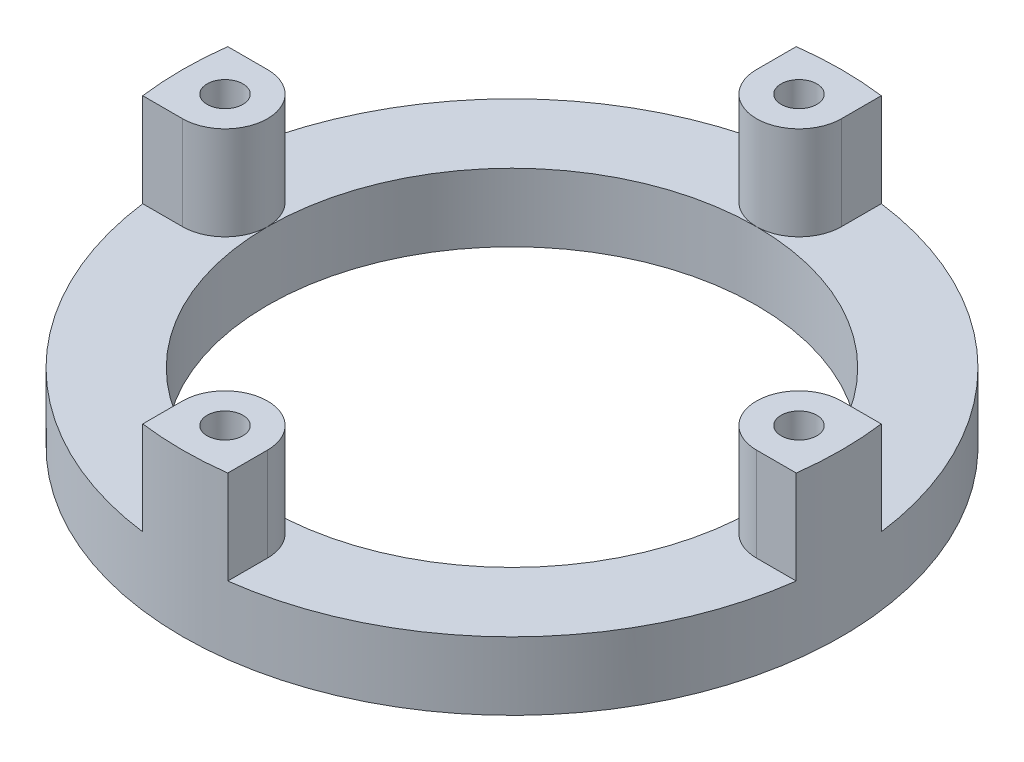
ISO-10303-21;
HEADER;
FILE_DESCRIPTION(('STEP AP214'),'2;1');
FILE_NAME('part.step','',(''),(''),'','','');
FILE_SCHEMA(('AUTOMOTIVE_DESIGN { 1 0 10303 214 1 1 1 1 }'));
ENDSEC;
DATA;
#1=APPLICATION_CONTEXT('core data for automotive mechanical design processes');
#2=APPLICATION_PROTOCOL_DEFINITION('international standard','automotive_design',2000,#1);
#3=PRODUCT_CONTEXT('',#1,'mechanical');
#4=PRODUCT('Part','Part','',(#3));
#5=PRODUCT_RELATED_PRODUCT_CATEGORY('part','',(#4));
#6=PRODUCT_DEFINITION_FORMATION('','',#4);
#7=PRODUCT_DEFINITION_CONTEXT('part definition',#1,'design');
#8=PRODUCT_DEFINITION('design','',#6,#7);
#9=PRODUCT_DEFINITION_SHAPE('','',#8);
#10=(LENGTH_UNIT() NAMED_UNIT(*) SI_UNIT(.MILLI.,.METRE.));
#11=(NAMED_UNIT(*) PLANE_ANGLE_UNIT() SI_UNIT($,.RADIAN.));
#12=(NAMED_UNIT(*) SI_UNIT($,.STERADIAN.) SOLID_ANGLE_UNIT());
#13=UNCERTAINTY_MEASURE_WITH_UNIT(LENGTH_MEASURE(1.E-05),#10,'distance_accuracy_value','');
#14=(GEOMETRIC_REPRESENTATION_CONTEXT(3) GLOBAL_UNCERTAINTY_ASSIGNED_CONTEXT((#13)) GLOBAL_UNIT_ASSIGNED_CONTEXT((#10,
#11,#12)) REPRESENTATION_CONTEXT('',''));
#15=CARTESIAN_POINT('',(0.,0.,0.));
#16=DIRECTION('',(0.,0.,1.));
#17=DIRECTION('',(1.,0.,0.));
#18=AXIS2_PLACEMENT_3D('',#15,#16,#17);
#19=CARTESIAN_POINT('',(0.,20.32,0.));
#20=DIRECTION('',(0.,1.,0.));
#21=DIRECTION('',(0.,0.,1.));
#22=AXIS2_PLACEMENT_3D('',#19,#20,#21);
#23=PLANE('',#22);
#24=CARTESIAN_POINT('',(0.,20.32,0.));
#25=DIRECTION('',(0.,1.,0.));
#26=DIRECTION('',(0.,0.,1.));
#27=AXIS2_PLACEMENT_3D('',#24,#25,#26);
#28=CIRCLE('',#27,98.425);
#29=CARTESIAN_POINT('',(12.7,20.32,97.6022060457652));
#30=VERTEX_POINT('',#29);
#31=CARTESIAN_POINT('',(97.6022060457653,20.32,12.699999999999));
#32=VERTEX_POINT('',#31);
#33=EDGE_CURVE('E443',#30,#32,#28,.T.);
#34=ORIENTED_EDGE('',*,*,#33,.T.);
#35=DIRECTION('',(1.,0.,0.));
#36=VECTOR('',#35,1.);
#37=CARTESIAN_POINT('',(85.7250000000001,20.32,12.6999999999991));
#38=LINE('',#37,#36);
#39=CARTESIAN_POINT('',(85.725,20.32,12.6999999999991));
#40=VERTEX_POINT('',#39);
#41=EDGE_CURVE('E55',#40,#32,#38,.T.);
#42=ORIENTED_EDGE('',*,*,#41,.F.);
#43=CARTESIAN_POINT('',(85.725,20.32,-8.97921713316983E-13));
#44=DIRECTION('',(0.,1.,0.));
#45=DIRECTION('',(-1.,0.,0.));
#46=AXIS2_PLACEMENT_3D('',#43,#44,#45);
#47=CIRCLE('',#46,12.7);
#48=CARTESIAN_POINT('',(73.025,20.32,-7.64896274307059E-13));
#49=VERTEX_POINT('',#48);
#50=EDGE_CURVE('E190',#49,#40,#47,.T.);
#51=ORIENTED_EDGE('',*,*,#50,.F.);
#52=CARTESIAN_POINT('',(0.,20.32,0.));
#53=DIRECTION('',(0.,1.,0.));
#54=DIRECTION('',(0.,0.,1.));
#55=AXIS2_PLACEMENT_3D('',#52,#53,#54);
#56=CIRCLE('',#55,73.025);
#57=CARTESIAN_POINT('',(0.,20.32,73.025));
#58=VERTEX_POINT('',#57);
#59=EDGE_CURVE('E456',#58,#49,#56,.T.);
#60=ORIENTED_EDGE('',*,*,#59,.F.);
#61=CARTESIAN_POINT('',(0.,20.32,85.725));
#62=DIRECTION('',(0.,1.,0.));
#63=DIRECTION('',(0.,0.,-1.));
#64=AXIS2_PLACEMENT_3D('',#61,#62,#63);
#65=CIRCLE('',#64,12.7);
#66=CARTESIAN_POINT('',(12.7,20.32,85.725));
#67=VERTEX_POINT('',#66);
#68=EDGE_CURVE('E211',#67,#58,#65,.T.);
#69=ORIENTED_EDGE('',*,*,#68,.F.);
#70=DIRECTION('',(0.,0.,-1.));
#71=VECTOR('',#70,1.);
#72=CARTESIAN_POINT('',(12.7,20.32,85.725));
#73=LINE('',#72,#71);
#74=EDGE_CURVE('E204',#30,#67,#73,.T.);
#75=ORIENTED_EDGE('',*,*,#74,.F.);
#76=EDGE_LOOP('',(#34,#42,#51,#60,#69,#75));
#77=FACE_BOUND('',#76,.T.);
#78=ADVANCED_FACE('F40',(#77),#23,.T.);
#79=CARTESIAN_POINT('',(-97.6022060457651,20.32,12.7000000000003));
#80=VERTEX_POINT('',#79);
#81=CARTESIAN_POINT('',(-12.7,20.32,97.6022060457652));
#82=VERTEX_POINT('',#81);
#83=EDGE_CURVE('E312',#80,#82,#28,.T.);
#84=ORIENTED_EDGE('',*,*,#83,.T.);
#85=DIRECTION('',(0.,0.,1.));
#86=VECTOR('',#85,1.);
#87=CARTESIAN_POINT('',(-12.7,20.32,85.725));
#88=LINE('',#87,#86);
#89=CARTESIAN_POINT('',(-12.7,20.32,85.725));
#90=VERTEX_POINT('',#89);
#91=EDGE_CURVE('E214',#90,#82,#88,.T.);
#92=ORIENTED_EDGE('',*,*,#91,.F.);
#93=EDGE_CURVE('E194',#58,#90,#65,.T.);
#94=ORIENTED_EDGE('',*,*,#93,.F.);
#95=CARTESIAN_POINT('',(-73.025,20.32,2.5496542476902E-13));
#96=VERTEX_POINT('',#95);
#97=EDGE_CURVE('E306',#96,#58,#56,.T.);
#98=ORIENTED_EDGE('',*,*,#97,.F.);
#99=CARTESIAN_POINT('',(-85.725,20.32,2.99307237772328E-13));
#100=DIRECTION('',(0.,1.,0.));
#101=DIRECTION('',(1.,0.,0.));
#102=AXIS2_PLACEMENT_3D('',#99,#100,#101);
#103=CIRCLE('',#102,12.7);
#104=CARTESIAN_POINT('',(-85.725,20.32,12.7000000000003));
#105=VERTEX_POINT('',#104);
#106=EDGE_CURVE('E245',#105,#96,#103,.T.);
#107=ORIENTED_EDGE('',*,*,#106,.F.);
#108=DIRECTION('',(1.,0.,0.));
#109=VECTOR('',#108,1.);
#110=CARTESIAN_POINT('',(-85.725,20.32,12.7000000000003));
#111=LINE('',#110,#109);
#112=EDGE_CURVE('E238',#80,#105,#111,.T.);
#113=ORIENTED_EDGE('',*,*,#112,.F.);
#114=EDGE_LOOP('',(#84,#92,#94,#98,#107,#113));
#115=FACE_BOUND('',#114,.T.);
#116=ADVANCED_FACE('F327',(#115),#23,.T.);
#117=CARTESIAN_POINT('',(-12.7,20.32,-97.6022060457652));
#118=VERTEX_POINT('',#117);
#119=CARTESIAN_POINT('',(-97.6022060457652,20.32,-12.6999999999997));
#120=VERTEX_POINT('',#119);
#121=EDGE_CURVE('E310',#118,#120,#28,.T.);
#122=ORIENTED_EDGE('',*,*,#121,.T.);
#123=DIRECTION('',(-1.,0.,0.));
#124=VECTOR('',#123,1.);
#125=CARTESIAN_POINT('',(-85.725,20.32,-12.6999999999997));
#126=LINE('',#125,#124);
#127=CARTESIAN_POINT('',(-85.725,20.32,-12.6999999999997));
#128=VERTEX_POINT('',#127);
#129=EDGE_CURVE('E248',#128,#120,#126,.T.);
#130=ORIENTED_EDGE('',*,*,#129,.F.);
#131=EDGE_CURVE('E233',#96,#128,#103,.T.);
#132=ORIENTED_EDGE('',*,*,#131,.F.);
#133=CARTESIAN_POINT('',(0.,20.32,-73.025));
#134=VERTEX_POINT('',#133);
#135=EDGE_CURVE('E302',#134,#96,#56,.T.);
#136=ORIENTED_EDGE('',*,*,#135,.F.);
#137=CARTESIAN_POINT('',(0.,20.32,-85.725));
#138=DIRECTION('',(0.,1.,0.));
#139=DIRECTION('',(0.,0.,1.));
#140=AXIS2_PLACEMENT_3D('',#137,#138,#139);
#141=CIRCLE('',#140,12.7);
#142=CARTESIAN_POINT('',(-12.7,20.32,-85.725));
#143=VERTEX_POINT('',#142);
#144=EDGE_CURVE('E268',#143,#134,#141,.T.);
#145=ORIENTED_EDGE('',*,*,#144,.F.);
#146=DIRECTION('',(0.,0.,1.));
#147=VECTOR('',#146,1.);
#148=CARTESIAN_POINT('',(-12.7,20.32,-85.725));
#149=LINE('',#148,#147);
#150=EDGE_CURVE('E275',#118,#143,#149,.T.);
#151=ORIENTED_EDGE('',*,*,#150,.F.);
#152=EDGE_LOOP('',(#122,#130,#132,#136,#145,#151));
#153=FACE_BOUND('',#152,.T.);
#154=ADVANCED_FACE('F326',(#153),#23,.T.);
#155=EDGE_CURVE('E307',#49,#134,#56,.T.);
#156=ORIENTED_EDGE('',*,*,#155,.F.);
#157=CARTESIAN_POINT('',(85.7249999999999,20.32,-12.7000000000009));
#158=VERTEX_POINT('',#157);
#159=EDGE_CURVE('E63',#158,#49,#47,.T.);
#160=ORIENTED_EDGE('',*,*,#159,.F.);
#161=DIRECTION('',(-1.,0.,0.));
#162=VECTOR('',#161,1.);
#163=CARTESIAN_POINT('',(85.7249999999999,20.32,-12.7000000000009));
#164=LINE('',#163,#162);
#165=CARTESIAN_POINT('',(97.602206045765,20.32,-12.700000000001));
#166=VERTEX_POINT('',#165);
#167=EDGE_CURVE('E187',#166,#158,#164,.T.);
#168=ORIENTED_EDGE('',*,*,#167,.F.);
#169=CARTESIAN_POINT('',(12.7,20.32,-97.6022060457651));
#170=VERTEX_POINT('',#169);
#171=EDGE_CURVE('E313',#166,#170,#28,.T.);
#172=ORIENTED_EDGE('',*,*,#171,.T.);
#173=DIRECTION('',(0.,0.,-1.));
#174=VECTOR('',#173,1.);
#175=CARTESIAN_POINT('',(12.7,20.32,-85.725));
#176=LINE('',#175,#174);
#177=CARTESIAN_POINT('',(12.7,20.32,-85.725));
#178=VERTEX_POINT('',#177);
#179=EDGE_CURVE('E284',#178,#170,#176,.T.);
#180=ORIENTED_EDGE('',*,*,#179,.F.);
#181=EDGE_CURVE('E285',#134,#178,#141,.T.);
#182=ORIENTED_EDGE('',*,*,#181,.F.);
#183=EDGE_LOOP('',(#156,#160,#168,#172,#180,#182));
#184=FACE_BOUND('',#183,.T.);
#185=ADVANCED_FACE('F336',(#184),#23,.T.);
#186=CARTESIAN_POINT('',(0.,0.,0.));
#187=DIRECTION('',(0.,1.,0.));
#188=DIRECTION('',(0.,0.,1.));
#189=AXIS2_PLACEMENT_3D('',#186,#187,#188);
#190=PLANE('',#189);
#191=CARTESIAN_POINT('',(0.,0.,0.));
#192=DIRECTION('',(0.,1.,0.));
#193=DIRECTION('',(0.,0.,1.));
#194=AXIS2_PLACEMENT_3D('',#191,#192,#193);
#195=CIRCLE('',#194,98.425);
#196=CARTESIAN_POINT('',(0.,0.,98.425));
#197=VERTEX_POINT('',#196);
#198=EDGE_CURVE('E305',#197,#197,#195,.T.);
#199=ORIENTED_EDGE('',*,*,#198,.F.);
#200=EDGE_LOOP('',(#199));
#201=FACE_BOUND('',#200,.T.);
#202=CARTESIAN_POINT('',(0.,0.,0.));
#203=DIRECTION('',(0.,1.,0.));
#204=DIRECTION('',(0.,0.,1.));
#205=AXIS2_PLACEMENT_3D('',#202,#203,#204);
#206=CIRCLE('',#205,73.025);
#207=CARTESIAN_POINT('',(0.,0.,73.025));
#208=VERTEX_POINT('',#207);
#209=EDGE_CURVE('E301',#208,#208,#206,.T.);
#210=ORIENTED_EDGE('',*,*,#209,.T.);
#211=EDGE_LOOP('',(#210));
#212=FACE_BOUND('',#211,.T.);
#213=ADVANCED_FACE('F351',(#201,#212),#190,.F.);
#214=CARTESIAN_POINT('',(0.,20.32,0.));
#215=DIRECTION('',(0.,-1.,0.));
#216=DIRECTION('',(0.,0.,-1.));
#217=AXIS2_PLACEMENT_3D('',#214,#215,#216);
#218=CYLINDRICAL_SURFACE('',#217,98.425);
#219=ORIENTED_EDGE('',*,*,#121,.F.);
#220=DIRECTION('',(0.,-1.,0.));
#221=VECTOR('',#220,1.);
#222=CARTESIAN_POINT('',(-12.7,48.26,-97.6022060457652));
#223=LINE('',#222,#221);
#224=CARTESIAN_POINT('',(-12.7,48.26,-97.6022060457652));
#225=VERTEX_POINT('',#224);
#226=EDGE_CURVE('E292',#225,#118,#223,.T.);
#227=ORIENTED_EDGE('',*,*,#226,.F.);
#228=CARTESIAN_POINT('',(0.,48.26,0.));
#229=DIRECTION('',(0.,1.,0.));
#230=DIRECTION('',(0.,0.,1.));
#231=AXIS2_PLACEMENT_3D('',#228,#229,#230);
#232=CIRCLE('',#231,98.425);
#233=CARTESIAN_POINT('',(12.7,48.26,-97.6022060457651));
#234=VERTEX_POINT('',#233);
#235=EDGE_CURVE('E277',#234,#225,#232,.T.);
#236=ORIENTED_EDGE('',*,*,#235,.F.);
#237=DIRECTION('',(0.,-1.,0.));
#238=VECTOR('',#237,1.);
#239=CARTESIAN_POINT('',(12.7,48.26,-97.6022060457651));
#240=LINE('',#239,#238);
#241=EDGE_CURVE('E295',#234,#170,#240,.T.);
#242=ORIENTED_EDGE('',*,*,#241,.T.);
#243=ORIENTED_EDGE('',*,*,#171,.F.);
#244=DIRECTION('',(0.,-1.,0.));
#245=VECTOR('',#244,1.);
#246=CARTESIAN_POINT('',(97.602206045765,48.26,-12.700000000001));
#247=LINE('',#246,#245);
#248=CARTESIAN_POINT('',(97.602206045765,48.26,-12.700000000001));
#249=VERTEX_POINT('',#248);
#250=EDGE_CURVE('E196',#249,#166,#247,.T.);
#251=ORIENTED_EDGE('',*,*,#250,.F.);
#252=CARTESIAN_POINT('',(0.,48.26,0.));
#253=DIRECTION('',(0.,1.,0.));
#254=DIRECTION('',(-1.,0.,0.));
#255=AXIS2_PLACEMENT_3D('',#252,#253,#254);
#256=CIRCLE('',#255,98.425);
#257=CARTESIAN_POINT('',(97.6022060457653,48.26,12.699999999999));
#258=VERTEX_POINT('',#257);
#259=EDGE_CURVE('E176',#258,#249,#256,.T.);
#260=ORIENTED_EDGE('',*,*,#259,.F.);
#261=DIRECTION('',(0.,-1.,0.));
#262=VECTOR('',#261,1.);
#263=CARTESIAN_POINT('',(97.6022060457653,48.26,12.699999999999));
#264=LINE('',#263,#262);
#265=EDGE_CURVE('E173',#258,#32,#264,.T.);
#266=ORIENTED_EDGE('',*,*,#265,.T.);
#267=ORIENTED_EDGE('',*,*,#33,.F.);
#268=DIRECTION('',(0.,-1.,0.));
#269=VECTOR('',#268,1.);
#270=CARTESIAN_POINT('',(12.7,48.26,97.6022060457652));
#271=LINE('',#270,#269);
#272=CARTESIAN_POINT('',(12.7,48.26,97.6022060457652));
#273=VERTEX_POINT('',#272);
#274=EDGE_CURVE('E221',#273,#30,#271,.T.);
#275=ORIENTED_EDGE('',*,*,#274,.F.);
#276=CARTESIAN_POINT('',(0.,48.26,0.));
#277=DIRECTION('',(0.,1.,0.));
#278=DIRECTION('',(0.,0.,-1.));
#279=AXIS2_PLACEMENT_3D('',#276,#277,#278);
#280=CIRCLE('',#279,98.425);
#281=CARTESIAN_POINT('',(-12.7,48.26,97.6022060457651));
#282=VERTEX_POINT('',#281);
#283=EDGE_CURVE('E206',#282,#273,#280,.T.);
#284=ORIENTED_EDGE('',*,*,#283,.F.);
#285=DIRECTION('',(0.,-1.,0.));
#286=VECTOR('',#285,1.);
#287=CARTESIAN_POINT('',(-12.7,48.26,97.6022060457651));
#288=LINE('',#287,#286);
#289=EDGE_CURVE('E224',#282,#82,#288,.T.);
#290=ORIENTED_EDGE('',*,*,#289,.T.);
#291=ORIENTED_EDGE('',*,*,#83,.F.);
#292=DIRECTION('',(0.,-1.,0.));
#293=VECTOR('',#292,1.);
#294=CARTESIAN_POINT('',(-97.6022060457651,48.26,12.7000000000003));
#295=LINE('',#294,#293);
#296=CARTESIAN_POINT('',(-97.6022060457651,48.26,12.7000000000003));
#297=VERTEX_POINT('',#296);
#298=EDGE_CURVE('E255',#297,#80,#295,.T.);
#299=ORIENTED_EDGE('',*,*,#298,.F.);
#300=CARTESIAN_POINT('',(0.,48.26,0.));
#301=DIRECTION('',(0.,1.,0.));
#302=DIRECTION('',(1.,0.,0.));
#303=AXIS2_PLACEMENT_3D('',#300,#301,#302);
#304=CIRCLE('',#303,98.425);
#305=CARTESIAN_POINT('',(-97.6022060457652,48.26,-12.6999999999997));
#306=VERTEX_POINT('',#305);
#307=EDGE_CURVE('E240',#306,#297,#304,.T.);
#308=ORIENTED_EDGE('',*,*,#307,.F.);
#309=DIRECTION('',(0.,-1.,0.));
#310=VECTOR('',#309,1.);
#311=CARTESIAN_POINT('',(-97.6022060457652,48.26,-12.6999999999997));
#312=LINE('',#311,#310);
#313=EDGE_CURVE('E258',#306,#120,#312,.T.);
#314=ORIENTED_EDGE('',*,*,#313,.T.);
#315=EDGE_LOOP('',(#219,#227,#236,#242,#243,#251,#260,#266,#267,#275,#284,#290,#291,#299,#308,#314));
#316=FACE_BOUND('',#315,.T.);
#317=ORIENTED_EDGE('',*,*,#198,.T.);
#318=EDGE_LOOP('',(#317));
#319=FACE_BOUND('',#318,.T.);
#320=ADVANCED_FACE('F42',(#316,#319),#218,.T.);
#321=CARTESIAN_POINT('',(0.,20.32,0.));
#322=DIRECTION('',(0.,-1.,0.));
#323=DIRECTION('',(0.,0.,-1.));
#324=AXIS2_PLACEMENT_3D('',#321,#322,#323);
#325=CYLINDRICAL_SURFACE('',#324,73.025);
#326=ORIENTED_EDGE('',*,*,#135,.T.);
#327=ORIENTED_EDGE('',*,*,#97,.T.);
#328=ORIENTED_EDGE('',*,*,#59,.T.);
#329=ORIENTED_EDGE('',*,*,#155,.T.);
#330=EDGE_LOOP('',(#326,#327,#328,#329));
#331=FACE_BOUND('',#330,.T.);
#332=ORIENTED_EDGE('',*,*,#209,.F.);
#333=EDGE_LOOP('',(#332));
#334=FACE_BOUND('',#333,.T.);
#335=ADVANCED_FACE('F406',(#331,#334),#325,.F.);
#336=CARTESIAN_POINT('',(0.,48.26,-85.725));
#337=DIRECTION('',(0.,1.,0.));
#338=DIRECTION('',(0.,0.,1.));
#339=AXIS2_PLACEMENT_3D('',#336,#337,#338);
#340=PLANE('',#339);
#341=CARTESIAN_POINT('',(0.,48.26,-85.725));
#342=DIRECTION('',(0.,1.,0.));
#343=DIRECTION('',(0.,0.,1.));
#344=AXIS2_PLACEMENT_3D('',#341,#342,#343);
#345=CIRCLE('',#344,12.7);
#346=CARTESIAN_POINT('',(-12.7,48.26,-85.725));
#347=VERTEX_POINT('',#346);
#348=CARTESIAN_POINT('',(12.7,48.26,-85.725));
#349=VERTEX_POINT('',#348);
#350=EDGE_CURVE('E271',#347,#349,#345,.T.);
#351=ORIENTED_EDGE('',*,*,#350,.T.);
#352=DIRECTION('',(0.,0.,-1.));
#353=VECTOR('',#352,1.);
#354=CARTESIAN_POINT('',(12.7,48.26,-85.725));
#355=LINE('',#354,#353);
#356=EDGE_CURVE('E274',#349,#234,#355,.T.);
#357=ORIENTED_EDGE('',*,*,#356,.T.);
#358=ORIENTED_EDGE('',*,*,#235,.T.);
#359=DIRECTION('',(0.,0.,1.));
#360=VECTOR('',#359,1.);
#361=CARTESIAN_POINT('',(-12.7,48.26,-85.725));
#362=LINE('',#361,#360);
#363=EDGE_CURVE('E279',#225,#347,#362,.T.);
#364=ORIENTED_EDGE('',*,*,#363,.T.);
#365=EDGE_LOOP('',(#351,#357,#358,#364));
#366=FACE_BOUND('',#365,.T.);
#367=CARTESIAN_POINT('',(0.,48.26,-85.725));
#368=DIRECTION('',(0.,1.,0.));
#369=DIRECTION('',(0.,0.,1.));
#370=AXIS2_PLACEMENT_3D('',#367,#368,#369);
#371=CIRCLE('',#370,5.334);
#372=CARTESIAN_POINT('',(0.,48.26,-80.391));
#373=VERTEX_POINT('',#372);
#374=EDGE_CURVE('E265',#373,#373,#371,.T.);
#375=ORIENTED_EDGE('',*,*,#374,.F.);
#376=EDGE_LOOP('',(#375));
#377=FACE_BOUND('',#376,.T.);
#378=ADVANCED_FACE('F402',(#366,#377),#340,.T.);
#379=CARTESIAN_POINT('',(0.,48.26,-85.725));
#380=DIRECTION('',(0.,-1.,0.));
#381=DIRECTION('',(0.,0.,-1.));
#382=AXIS2_PLACEMENT_3D('',#379,#380,#381);
#383=CYLINDRICAL_SURFACE('',#382,12.7);
#384=ORIENTED_EDGE('',*,*,#144,.T.);
#385=ORIENTED_EDGE('',*,*,#181,.T.);
#386=DIRECTION('',(0.,-1.,0.));
#387=VECTOR('',#386,1.);
#388=CARTESIAN_POINT('',(12.7,48.26,-85.725));
#389=LINE('',#388,#387);
#390=EDGE_CURVE('E298',#349,#178,#389,.T.);
#391=ORIENTED_EDGE('',*,*,#390,.F.);
#392=ORIENTED_EDGE('',*,*,#350,.F.);
#393=DIRECTION('',(0.,-1.,0.));
#394=VECTOR('',#393,1.);
#395=CARTESIAN_POINT('',(-12.7,48.26,-85.725));
#396=LINE('',#395,#394);
#397=EDGE_CURVE('E281',#347,#143,#396,.T.);
#398=ORIENTED_EDGE('',*,*,#397,.T.);
#399=EDGE_LOOP('',(#384,#385,#391,#392,#398));
#400=FACE_BOUND('',#399,.T.);
#401=ADVANCED_FACE('F405',(#400),#383,.T.);
#402=CARTESIAN_POINT('',(12.7,48.26,-85.725));
#403=DIRECTION('',(-1.,0.,0.));
#404=DIRECTION('',(0.,0.,1.));
#405=AXIS2_PLACEMENT_3D('',#402,#403,#404);
#406=PLANE('',#405);
#407=ORIENTED_EDGE('',*,*,#179,.T.);
#408=ORIENTED_EDGE('',*,*,#241,.F.);
#409=ORIENTED_EDGE('',*,*,#356,.F.);
#410=ORIENTED_EDGE('',*,*,#390,.T.);
#411=EDGE_LOOP('',(#407,#408,#409,#410));
#412=FACE_BOUND('',#411,.T.);
#413=ADVANCED_FACE('F410',(#412),#406,.F.);
#414=CARTESIAN_POINT('',(-12.7,48.26,-85.725));
#415=DIRECTION('',(1.,0.,0.));
#416=DIRECTION('',(0.,0.,-1.));
#417=AXIS2_PLACEMENT_3D('',#414,#415,#416);
#418=PLANE('',#417);
#419=ORIENTED_EDGE('',*,*,#150,.T.);
#420=ORIENTED_EDGE('',*,*,#397,.F.);
#421=ORIENTED_EDGE('',*,*,#363,.F.);
#422=ORIENTED_EDGE('',*,*,#226,.T.);
#423=EDGE_LOOP('',(#419,#420,#421,#422));
#424=FACE_BOUND('',#423,.T.);
#425=ADVANCED_FACE('F368',(#424),#418,.F.);
#426=CARTESIAN_POINT('',(0.,48.26,-85.725));
#427=DIRECTION('',(0.,-1.,0.));
#428=DIRECTION('',(0.,0.,-1.));
#429=AXIS2_PLACEMENT_3D('',#426,#427,#428);
#430=CYLINDRICAL_SURFACE('',#429,5.334);
#431=ORIENTED_EDGE('',*,*,#374,.T.);
#432=EDGE_LOOP('',(#431));
#433=FACE_BOUND('',#432,.T.);
#434=CARTESIAN_POINT('',(0.,20.32,-85.725));
#435=DIRECTION('',(0.,1.,0.));
#436=DIRECTION('',(0.,0.,1.));
#437=AXIS2_PLACEMENT_3D('',#434,#435,#436);
#438=CIRCLE('',#437,5.334);
#439=CARTESIAN_POINT('',(0.,20.32,-80.391));
#440=VERTEX_POINT('',#439);
#441=EDGE_CURVE('E264',#440,#440,#438,.T.);
#442=ORIENTED_EDGE('',*,*,#441,.F.);
#443=EDGE_LOOP('',(#442));
#444=FACE_BOUND('',#443,.T.);
#445=ADVANCED_FACE('F359',(#433,#444),#430,.F.);
#446=ORIENTED_EDGE('',*,*,#441,.T.);
#447=EDGE_LOOP('',(#446));
#448=FACE_BOUND('',#447,.T.);
#449=ADVANCED_FACE('F352',(#448),#23,.T.);
#450=CARTESIAN_POINT('',(-85.725,48.26,2.99307237772328E-13));
#451=DIRECTION('',(0.,1.,0.));
#452=DIRECTION('',(1.,0.,0.));
#453=AXIS2_PLACEMENT_3D('',#450,#451,#452);
#454=PLANE('',#453);
#455=CARTESIAN_POINT('',(-85.725,48.26,2.99307237772328E-13));
#456=DIRECTION('',(0.,1.,0.));
#457=DIRECTION('',(1.,0.,0.));
#458=AXIS2_PLACEMENT_3D('',#455,#456,#457);
#459=CIRCLE('',#458,12.7);
#460=CARTESIAN_POINT('',(-85.725,48.26,12.7000000000003));
#461=VERTEX_POINT('',#460);
#462=CARTESIAN_POINT('',(-85.725,48.26,-12.6999999999997));
#463=VERTEX_POINT('',#462);
#464=EDGE_CURVE('E234',#461,#463,#459,.T.);
#465=ORIENTED_EDGE('',*,*,#464,.T.);
#466=DIRECTION('',(-1.,0.,0.));
#467=VECTOR('',#466,1.);
#468=CARTESIAN_POINT('',(-85.725,48.26,-12.6999999999997));
#469=LINE('',#468,#467);
#470=EDGE_CURVE('E237',#463,#306,#469,.T.);
#471=ORIENTED_EDGE('',*,*,#470,.T.);
#472=ORIENTED_EDGE('',*,*,#307,.T.);
#473=DIRECTION('',(1.,0.,0.));
#474=VECTOR('',#473,1.);
#475=CARTESIAN_POINT('',(-85.725,48.26,12.7000000000003));
#476=LINE('',#475,#474);
#477=EDGE_CURVE('E242',#297,#461,#476,.T.);
#478=ORIENTED_EDGE('',*,*,#477,.T.);
#479=EDGE_LOOP('',(#465,#471,#472,#478));
#480=FACE_BOUND('',#479,.T.);
#481=CARTESIAN_POINT('',(-85.725,48.26,2.99307237772328E-13));
#482=DIRECTION('',(0.,1.,0.));
#483=DIRECTION('',(1.,0.,0.));
#484=AXIS2_PLACEMENT_3D('',#481,#482,#483);
#485=CIRCLE('',#484,5.334);
#486=CARTESIAN_POINT('',(-80.391,48.26,2.80683676310938E-13));
#487=VERTEX_POINT('',#486);
#488=EDGE_CURVE('E230',#487,#487,#485,.T.);
#489=ORIENTED_EDGE('',*,*,#488,.F.);
#490=EDGE_LOOP('',(#489));
#491=FACE_BOUND('',#490,.T.);
#492=ADVANCED_FACE('F358',(#480,#491),#454,.T.);
#493=CARTESIAN_POINT('',(-85.725,48.26,2.99307237772328E-13));
#494=DIRECTION('',(0.,-1.,0.));
#495=DIRECTION('',(0.,0.,-1.));
#496=AXIS2_PLACEMENT_3D('',#493,#494,#495);
#497=CYLINDRICAL_SURFACE('',#496,12.7);
#498=ORIENTED_EDGE('',*,*,#106,.T.);
#499=ORIENTED_EDGE('',*,*,#131,.T.);
#500=DIRECTION('',(0.,-1.,0.));
#501=VECTOR('',#500,1.);
#502=CARTESIAN_POINT('',(-85.725,48.26,-12.6999999999997));
#503=LINE('',#502,#501);
#504=EDGE_CURVE('E261',#463,#128,#503,.T.);
#505=ORIENTED_EDGE('',*,*,#504,.F.);
#506=ORIENTED_EDGE('',*,*,#464,.F.);
#507=DIRECTION('',(0.,-1.,0.));
#508=VECTOR('',#507,1.);
#509=CARTESIAN_POINT('',(-85.725,48.26,12.7000000000003));
#510=LINE('',#509,#508);
#511=EDGE_CURVE('E244',#461,#105,#510,.T.);
#512=ORIENTED_EDGE('',*,*,#511,.T.);
#513=EDGE_LOOP('',(#498,#499,#505,#506,#512));
#514=FACE_BOUND('',#513,.T.);
#515=ADVANCED_FACE('F365',(#514),#497,.T.);
#516=CARTESIAN_POINT('',(-85.725,48.26,-12.6999999999997));
#517=DIRECTION('',(0.,0.,1.));
#518=DIRECTION('',(1.,0.,0.));
#519=AXIS2_PLACEMENT_3D('',#516,#517,#518);
#520=PLANE('',#519);
#521=ORIENTED_EDGE('',*,*,#129,.T.);
#522=ORIENTED_EDGE('',*,*,#313,.F.);
#523=ORIENTED_EDGE('',*,*,#470,.F.);
#524=ORIENTED_EDGE('',*,*,#504,.T.);
#525=EDGE_LOOP('',(#521,#522,#523,#524));
#526=FACE_BOUND('',#525,.T.);
#527=ADVANCED_FACE('F390',(#526),#520,.F.);
#528=CARTESIAN_POINT('',(-85.725,48.26,12.7000000000003));
#529=DIRECTION('',(0.,0.,-1.));
#530=DIRECTION('',(-1.,0.,0.));
#531=AXIS2_PLACEMENT_3D('',#528,#529,#530);
#532=PLANE('',#531);
#533=ORIENTED_EDGE('',*,*,#112,.T.);
#534=ORIENTED_EDGE('',*,*,#511,.F.);
#535=ORIENTED_EDGE('',*,*,#477,.F.);
#536=ORIENTED_EDGE('',*,*,#298,.T.);
#537=EDGE_LOOP('',(#533,#534,#535,#536));
#538=FACE_BOUND('',#537,.T.);
#539=ADVANCED_FACE('F382',(#538),#532,.F.);
#540=CARTESIAN_POINT('',(-85.725,48.26,2.99307237772328E-13));
#541=DIRECTION('',(0.,-1.,0.));
#542=DIRECTION('',(0.,0.,-1.));
#543=AXIS2_PLACEMENT_3D('',#540,#541,#542);
#544=CYLINDRICAL_SURFACE('',#543,5.334);
#545=ORIENTED_EDGE('',*,*,#488,.T.);
#546=EDGE_LOOP('',(#545));
#547=FACE_BOUND('',#546,.T.);
#548=CARTESIAN_POINT('',(-85.725,20.32,2.99307237772328E-13));
#549=DIRECTION('',(0.,1.,0.));
#550=DIRECTION('',(0.,0.,1.));
#551=AXIS2_PLACEMENT_3D('',#548,#549,#550);
#552=CIRCLE('',#551,5.334);
#553=CARTESIAN_POINT('',(-85.725,20.32,5.3340000000003));
#554=VERTEX_POINT('',#553);
#555=EDGE_CURVE('E316',#554,#554,#552,.F.);
#556=ORIENTED_EDGE('',*,*,#555,.T.);
#557=EDGE_LOOP('',(#556));
#558=FACE_BOUND('',#557,.T.);
#559=ADVANCED_FACE('F373',(#547,#558),#544,.F.);
#560=ORIENTED_EDGE('',*,*,#555,.F.);
#561=EDGE_LOOP('',(#560));
#562=FACE_BOUND('',#561,.T.);
#563=ADVANCED_FACE('F340',(#562),#23,.T.);
#564=CARTESIAN_POINT('',(0.,48.26,85.725));
#565=DIRECTION('',(0.,1.,0.));
#566=DIRECTION('',(0.,0.,-1.));
#567=AXIS2_PLACEMENT_3D('',#564,#565,#566);
#568=PLANE('',#567);
#569=CARTESIAN_POINT('',(0.,48.26,85.725));
#570=DIRECTION('',(0.,1.,0.));
#571=DIRECTION('',(0.,0.,-1.));
#572=AXIS2_PLACEMENT_3D('',#569,#570,#571);
#573=CIRCLE('',#572,12.7);
#574=CARTESIAN_POINT('',(12.7,48.26,85.725));
#575=VERTEX_POINT('',#574);
#576=CARTESIAN_POINT('',(-12.7,48.26,85.725));
#577=VERTEX_POINT('',#576);
#578=EDGE_CURVE('E200',#575,#577,#573,.T.);
#579=ORIENTED_EDGE('',*,*,#578,.T.);
#580=DIRECTION('',(0.,0.,1.));
#581=VECTOR('',#580,1.);
#582=CARTESIAN_POINT('',(-12.7,48.26,85.725));
#583=LINE('',#582,#581);
#584=EDGE_CURVE('E203',#577,#282,#583,.T.);
#585=ORIENTED_EDGE('',*,*,#584,.T.);
#586=ORIENTED_EDGE('',*,*,#283,.T.);
#587=DIRECTION('',(0.,0.,-1.));
#588=VECTOR('',#587,1.);
#589=CARTESIAN_POINT('',(12.7,48.26,85.725));
#590=LINE('',#589,#588);
#591=EDGE_CURVE('E208',#273,#575,#590,.T.);
#592=ORIENTED_EDGE('',*,*,#591,.T.);
#593=EDGE_LOOP('',(#579,#585,#586,#592));
#594=FACE_BOUND('',#593,.T.);
#595=CARTESIAN_POINT('',(0.,48.26,85.725));
#596=DIRECTION('',(0.,1.,0.));
#597=DIRECTION('',(0.,0.,-1.));
#598=AXIS2_PLACEMENT_3D('',#595,#596,#597);
#599=CIRCLE('',#598,5.334);
#600=CARTESIAN_POINT('',(0.,48.26,80.391));
#601=VERTEX_POINT('',#600);
#602=EDGE_CURVE('E191',#601,#601,#599,.T.);
#603=ORIENTED_EDGE('',*,*,#602,.F.);
#604=EDGE_LOOP('',(#603));
#605=FACE_BOUND('',#604,.T.);
#606=ADVANCED_FACE('F372',(#594,#605),#568,.T.);
#607=CARTESIAN_POINT('',(0.,48.26,85.725));
#608=DIRECTION('',(0.,-1.,0.));
#609=DIRECTION('',(0.,0.,-1.));
#610=AXIS2_PLACEMENT_3D('',#607,#608,#609);
#611=CYLINDRICAL_SURFACE('',#610,12.7);
#612=ORIENTED_EDGE('',*,*,#68,.T.);
#613=ORIENTED_EDGE('',*,*,#93,.T.);
#614=DIRECTION('',(0.,-1.,0.));
#615=VECTOR('',#614,1.);
#616=CARTESIAN_POINT('',(-12.7,48.26,85.725));
#617=LINE('',#616,#615);
#618=EDGE_CURVE('E227',#577,#90,#617,.T.);
#619=ORIENTED_EDGE('',*,*,#618,.F.);
#620=ORIENTED_EDGE('',*,*,#578,.F.);
#621=DIRECTION('',(0.,-1.,0.));
#622=VECTOR('',#621,1.);
#623=CARTESIAN_POINT('',(12.7,48.26,85.725));
#624=LINE('',#623,#622);
#625=EDGE_CURVE('E210',#575,#67,#624,.T.);
#626=ORIENTED_EDGE('',*,*,#625,.T.);
#627=EDGE_LOOP('',(#612,#613,#619,#620,#626));
#628=FACE_BOUND('',#627,.T.);
#629=ADVANCED_FACE('F379',(#628),#611,.T.);
#630=CARTESIAN_POINT('',(-12.7,48.26,85.725));
#631=DIRECTION('',(1.,0.,0.));
#632=DIRECTION('',(0.,0.,-1.));
#633=AXIS2_PLACEMENT_3D('',#630,#631,#632);
#634=PLANE('',#633);
#635=ORIENTED_EDGE('',*,*,#91,.T.);
#636=ORIENTED_EDGE('',*,*,#289,.F.);
#637=ORIENTED_EDGE('',*,*,#584,.F.);
#638=ORIENTED_EDGE('',*,*,#618,.T.);
#639=EDGE_LOOP('',(#635,#636,#637,#638));
#640=FACE_BOUND('',#639,.T.);
#641=ADVANCED_FACE('F486',(#640),#634,.F.);
#642=CARTESIAN_POINT('',(12.7,48.26,85.725));
#643=DIRECTION('',(-1.,0.,0.));
#644=DIRECTION('',(0.,0.,1.));
#645=AXIS2_PLACEMENT_3D('',#642,#643,#644);
#646=PLANE('',#645);
#647=ORIENTED_EDGE('',*,*,#74,.T.);
#648=ORIENTED_EDGE('',*,*,#625,.F.);
#649=ORIENTED_EDGE('',*,*,#591,.F.);
#650=ORIENTED_EDGE('',*,*,#274,.T.);
#651=EDGE_LOOP('',(#647,#648,#649,#650));
#652=FACE_BOUND('',#651,.T.);
#653=ADVANCED_FACE('F333',(#652),#646,.F.);
#654=CARTESIAN_POINT('',(0.,48.26,85.725));
#655=DIRECTION('',(0.,-1.,0.));
#656=DIRECTION('',(0.,0.,-1.));
#657=AXIS2_PLACEMENT_3D('',#654,#655,#656);
#658=CYLINDRICAL_SURFACE('',#657,5.334);
#659=ORIENTED_EDGE('',*,*,#602,.T.);
#660=EDGE_LOOP('',(#659));
#661=FACE_BOUND('',#660,.T.);
#662=CARTESIAN_POINT('',(0.,20.32,85.725));
#663=DIRECTION('',(0.,1.,0.));
#664=DIRECTION('',(0.,0.,1.));
#665=AXIS2_PLACEMENT_3D('',#662,#663,#664);
#666=CIRCLE('',#665,5.334);
#667=CARTESIAN_POINT('',(0.,20.32,91.059));
#668=VERTEX_POINT('',#667);
#669=EDGE_CURVE('E48',#668,#668,#666,.F.);
#670=ORIENTED_EDGE('',*,*,#669,.T.);
#671=EDGE_LOOP('',(#670));
#672=FACE_BOUND('',#671,.T.);
#673=ADVANCED_FACE('F321',(#661,#672),#658,.F.);
#674=ORIENTED_EDGE('',*,*,#669,.F.);
#675=EDGE_LOOP('',(#674));
#676=FACE_BOUND('',#675,.T.);
#677=ADVANCED_FACE('F323',(#676),#23,.T.);
#678=CARTESIAN_POINT('',(85.725,48.26,-8.97921713316983E-13));
#679=DIRECTION('',(0.,1.,0.));
#680=DIRECTION('',(-1.,0.,0.));
#681=AXIS2_PLACEMENT_3D('',#678,#679,#680);
#682=PLANE('',#681);
#683=CARTESIAN_POINT('',(85.725,48.26,-8.97921713316983E-13));
#684=DIRECTION('',(0.,1.,0.));
#685=DIRECTION('',(-1.,0.,0.));
#686=AXIS2_PLACEMENT_3D('',#683,#684,#685);
#687=CIRCLE('',#686,12.7);
#688=CARTESIAN_POINT('',(85.7249999999999,48.26,-12.7000000000009));
#689=VERTEX_POINT('',#688);
#690=CARTESIAN_POINT('',(85.7250000000001,48.26,12.6999999999991));
#691=VERTEX_POINT('',#690);
#692=EDGE_CURVE('E177',#689,#691,#687,.T.);
#693=ORIENTED_EDGE('',*,*,#692,.T.);
#694=DIRECTION('',(1.,0.,0.));
#695=VECTOR('',#694,1.);
#696=CARTESIAN_POINT('',(85.7250000000001,48.26,12.6999999999991));
#697=LINE('',#696,#695);
#698=EDGE_CURVE('E167',#691,#258,#697,.T.);
#699=ORIENTED_EDGE('',*,*,#698,.T.);
#700=ORIENTED_EDGE('',*,*,#259,.T.);
#701=DIRECTION('',(-1.,0.,0.));
#702=VECTOR('',#701,1.);
#703=CARTESIAN_POINT('',(85.7249999999999,48.26,-12.7000000000009));
#704=LINE('',#703,#702);
#705=EDGE_CURVE('E183',#249,#689,#704,.T.);
#706=ORIENTED_EDGE('',*,*,#705,.T.);
#707=EDGE_LOOP('',(#693,#699,#700,#706));
#708=FACE_BOUND('',#707,.T.);
#709=CARTESIAN_POINT('',(85.725,48.26,-8.97921713316983E-13));
#710=DIRECTION('',(0.,1.,0.));
#711=DIRECTION('',(-1.,0.,0.));
#712=AXIS2_PLACEMENT_3D('',#709,#710,#711);
#713=CIRCLE('',#712,5.334);
#714=CARTESIAN_POINT('',(80.391,48.26,-8.42051028932815E-13));
#715=VERTEX_POINT('',#714);
#716=EDGE_CURVE('E461',#715,#715,#713,.T.);
#717=ORIENTED_EDGE('',*,*,#716,.F.);
#718=EDGE_LOOP('',(#717));
#719=FACE_BOUND('',#718,.T.);
#720=ADVANCED_FACE('F180',(#708,#719),#682,.T.);
#721=CARTESIAN_POINT('',(85.725,48.26,-8.97921713316983E-13));
#722=DIRECTION('',(0.,-1.,0.));
#723=DIRECTION('',(0.,0.,-1.));
#724=AXIS2_PLACEMENT_3D('',#721,#722,#723);
#725=CYLINDRICAL_SURFACE('',#724,12.7);
#726=ORIENTED_EDGE('',*,*,#159,.T.);
#727=ORIENTED_EDGE('',*,*,#50,.T.);
#728=DIRECTION('',(0.,-1.,0.));
#729=VECTOR('',#728,1.);
#730=CARTESIAN_POINT('',(85.7250000000001,48.26,12.6999999999991));
#731=LINE('',#730,#729);
#732=EDGE_CURVE('E171',#691,#40,#731,.T.);
#733=ORIENTED_EDGE('',*,*,#732,.F.);
#734=ORIENTED_EDGE('',*,*,#692,.F.);
#735=DIRECTION('',(0.,-1.,0.));
#736=VECTOR('',#735,1.);
#737=CARTESIAN_POINT('',(85.7249999999999,48.26,-12.7000000000009));
#738=LINE('',#737,#736);
#739=EDGE_CURVE('E458',#689,#158,#738,.T.);
#740=ORIENTED_EDGE('',*,*,#739,.T.);
#741=EDGE_LOOP('',(#726,#727,#733,#734,#740));
#742=FACE_BOUND('',#741,.T.);
#743=ADVANCED_FACE('F189',(#742),#725,.T.);
#744=CARTESIAN_POINT('',(85.7250000000001,48.26,12.6999999999991));
#745=DIRECTION('',(0.,0.,-1.));
#746=DIRECTION('',(-1.,0.,0.));
#747=AXIS2_PLACEMENT_3D('',#744,#745,#746);
#748=PLANE('',#747);
#749=ORIENTED_EDGE('',*,*,#41,.T.);
#750=ORIENTED_EDGE('',*,*,#265,.F.);
#751=ORIENTED_EDGE('',*,*,#698,.F.);
#752=ORIENTED_EDGE('',*,*,#732,.T.);
#753=EDGE_LOOP('',(#749,#750,#751,#752));
#754=FACE_BOUND('',#753,.T.);
#755=ADVANCED_FACE('F169',(#754),#748,.F.);
#756=CARTESIAN_POINT('',(85.7249999999999,48.26,-12.7000000000009));
#757=DIRECTION('',(0.,0.,1.));
#758=DIRECTION('',(1.,0.,0.));
#759=AXIS2_PLACEMENT_3D('',#756,#757,#758);
#760=PLANE('',#759);
#761=ORIENTED_EDGE('',*,*,#167,.T.);
#762=ORIENTED_EDGE('',*,*,#739,.F.);
#763=ORIENTED_EDGE('',*,*,#705,.F.);
#764=ORIENTED_EDGE('',*,*,#250,.T.);
#765=EDGE_LOOP('',(#761,#762,#763,#764));
#766=FACE_BOUND('',#765,.T.);
#767=ADVANCED_FACE('F467',(#766),#760,.F.);
#768=CARTESIAN_POINT('',(85.725,48.26,-8.97921713316983E-13));
#769=DIRECTION('',(0.,-1.,0.));
#770=DIRECTION('',(0.,0.,-1.));
#771=AXIS2_PLACEMENT_3D('',#768,#769,#770);
#772=CYLINDRICAL_SURFACE('',#771,5.334);
#773=ORIENTED_EDGE('',*,*,#716,.T.);
#774=EDGE_LOOP('',(#773));
#775=FACE_BOUND('',#774,.T.);
#776=CARTESIAN_POINT('',(85.725,20.32,-8.97921713316983E-13));
#777=DIRECTION('',(0.,1.,0.));
#778=DIRECTION('',(0.,0.,1.));
#779=AXIS2_PLACEMENT_3D('',#776,#777,#778);
#780=CIRCLE('',#779,5.334);
#781=CARTESIAN_POINT('',(85.725,20.32,5.3339999999991));
#782=VERTEX_POINT('',#781);
#783=EDGE_CURVE('E11',#782,#782,#780,.F.);
#784=ORIENTED_EDGE('',*,*,#783,.T.);
#785=EDGE_LOOP('',(#784));
#786=FACE_BOUND('',#785,.T.);
#787=ADVANCED_FACE('F348',(#775,#786),#772,.F.);
#788=ORIENTED_EDGE('',*,*,#783,.F.);
#789=EDGE_LOOP('',(#788));
#790=FACE_BOUND('',#789,.T.);
#791=ADVANCED_FACE('F343',(#790),#23,.T.);
#792=CLOSED_SHELL('',(#78,#116,#154,#185,#213,#320,#335,#378,#401,#413,#425,#445,#449,#492,#515,
#527,#539,#559,#563,#606,#629,#641,#653,#673,#677,#720,#743,#755,#767,#787,#791));
#793=MANIFOLD_SOLID_BREP('B2',#792);
#794=ADVANCED_BREP_SHAPE_REPRESENTATION('',(#18,#793),#14);
#795=SHAPE_DEFINITION_REPRESENTATION(#9,#794);
ENDSEC;
END-ISO-10303-21;
